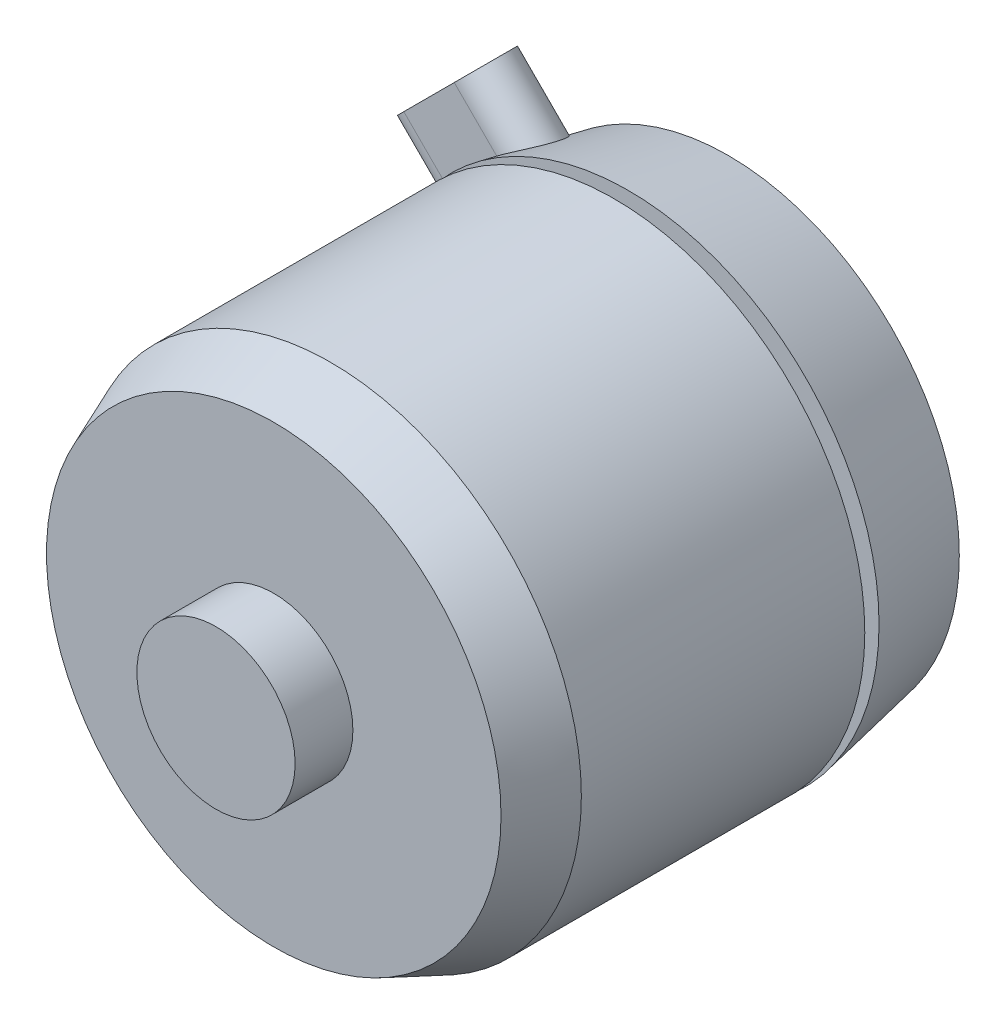
ISO-10303-21;
HEADER;
FILE_DESCRIPTION(('STEP AP214'),'2;1');
FILE_NAME('part.step','',(''),(''),'','','');
FILE_SCHEMA(('AUTOMOTIVE_DESIGN { 1 0 10303 214 1 1 1 1 }'));
ENDSEC;
DATA;
#1=APPLICATION_CONTEXT('core data for automotive mechanical design processes');
#2=APPLICATION_PROTOCOL_DEFINITION('international standard','automotive_design',2000,#1);
#3=PRODUCT_CONTEXT('',#1,'mechanical');
#4=PRODUCT('Part','Part','',(#3));
#5=PRODUCT_RELATED_PRODUCT_CATEGORY('part','',(#4));
#6=PRODUCT_DEFINITION_FORMATION('','',#4);
#7=PRODUCT_DEFINITION_CONTEXT('part definition',#1,'design');
#8=PRODUCT_DEFINITION('design','',#6,#7);
#9=PRODUCT_DEFINITION_SHAPE('','',#8);
#10=(LENGTH_UNIT() NAMED_UNIT(*) SI_UNIT(.MILLI.,.METRE.));
#11=(NAMED_UNIT(*) PLANE_ANGLE_UNIT() SI_UNIT($,.RADIAN.));
#12=(NAMED_UNIT(*) SI_UNIT($,.STERADIAN.) SOLID_ANGLE_UNIT());
#13=UNCERTAINTY_MEASURE_WITH_UNIT(LENGTH_MEASURE(1.E-05),#10,'distance_accuracy_value','');
#14=(GEOMETRIC_REPRESENTATION_CONTEXT(3) GLOBAL_UNCERTAINTY_ASSIGNED_CONTEXT((#13)) GLOBAL_UNIT_ASSIGNED_CONTEXT((#10,
#11,#12)) REPRESENTATION_CONTEXT('',''));
#15=CARTESIAN_POINT('',(0.,0.,0.));
#16=DIRECTION('',(0.,0.,1.));
#17=DIRECTION('',(1.,0.,0.));
#18=AXIS2_PLACEMENT_3D('',#15,#16,#17);
#19=CARTESIAN_POINT('',(0.,0.,-35.9313000000001));
#20=DIRECTION('',(0.,0.,1.));
#21=DIRECTION('',(1.,0.,0.));
#22=AXIS2_PLACEMENT_3D('',#19,#20,#21);
#23=CONICAL_SURFACE('',#22,16.205000102,0.193271290948665);
#24=CARTESIAN_POINT('',(0.,0.,-35.9313000000001));
#25=DIRECTION('',(0.,0.,1.));
#26=DIRECTION('',(1.,0.,0.));
#27=AXIS2_PLACEMENT_3D('',#24,#25,#26);
#28=CIRCLE('',#27,16.205000102);
#29=CARTESIAN_POINT('',(16.205000102,0.,-35.9313000000001));
#30=VERTEX_POINT('',#29);
#31=EDGE_CURVE('E139',#30,#30,#28,.T.);
#32=ORIENTED_EDGE('',*,*,#31,.T.);
#33=EDGE_LOOP('',(#32));
#34=FACE_BOUND('',#33,.T.);
#35=CARTESIAN_POINT('',(0.,0.,-28.9313));
#36=DIRECTION('',(0.,0.,1.));
#37=DIRECTION('',(1.,0.,0.));
#38=AXIS2_PLACEMENT_3D('',#35,#36,#37);
#39=CIRCLE('',#38,17.575);
#40=CARTESIAN_POINT('',(17.575,0.,-28.9313));
#41=VERTEX_POINT('',#40);
#42=EDGE_CURVE('E142',#41,#41,#39,.T.);
#43=ORIENTED_EDGE('',*,*,#42,.F.);
#44=EDGE_LOOP('',(#43));
#45=FACE_BOUND('',#44,.T.);
#46=CARTESIAN_POINT('',(-14.6016099773207,8.38845156644895,-32.6886659903384));
#47=CARTESIAN_POINT('',(-14.634842600694,8.37199908024057,-32.5833121695496));
#48=CARTESIAN_POINT('',(-14.6638184328655,8.36387313299757,-32.4752219123758));
#49=CARTESIAN_POINT('',(-14.7126765892852,8.36439813635956,-32.2569589711486));
#50=CARTESIAN_POINT('',(-14.7325460256369,8.37307277400593,-32.1467835641319));
#51=CARTESIAN_POINT('',(-14.762801713273,8.40652937535166,-31.9278842343341));
#52=CARTESIAN_POINT('',(-14.7732113242243,8.43127140221818,-31.8191573930095));
#53=CARTESIAN_POINT('',(-14.7844906574289,8.49562620709599,-31.6057348715184));
#54=CARTESIAN_POINT('',(-14.7853615427116,8.53523717157123,-31.501038701455));
#55=CARTESIAN_POINT('',(-14.7773995719537,8.62958273782176,-31.2941870603564));
#56=CARTESIAN_POINT('',(-14.7681908399917,8.68484211043588,-31.192285668546));
#57=CARTESIAN_POINT('',(-14.7395385904898,8.80779927783415,-30.9978441012523));
#58=CARTESIAN_POINT('',(-14.7200919256182,8.87550089342789,-30.9053068149051));
#59=CARTESIAN_POINT('',(-14.6699394625699,9.02473326377082,-30.7276084636474));
#60=CARTESIAN_POINT('',(-14.6387408389036,9.10676963676632,-30.6430098137074));
#61=CARTESIAN_POINT('',(-14.5655754995301,9.27964747576915,-30.4887508653947));
#62=CARTESIAN_POINT('',(-14.5236074831435,9.37049000451983,-30.4190923732951));
#63=CARTESIAN_POINT('',(-14.4292313453783,9.55865730113803,-30.2965945836402));
#64=CARTESIAN_POINT('',(-14.3767758660356,9.65601008945664,-30.2438345131284));
#65=CARTESIAN_POINT('',(-14.2624991443972,9.85373387655455,-30.1576086280663));
#66=CARTESIAN_POINT('',(-14.2006805564987,9.95410401348637,-30.1241373581128));
#67=CARTESIAN_POINT('',(-14.0721239400299,10.1500221925748,-30.079163173143));
#68=CARTESIAN_POINT('',(-14.0057300739443,10.2455849376161,-30.0667437997778));
#69=CARTESIAN_POINT('',(-13.8676284272442,10.433313199939,-30.0619294811444));
#70=CARTESIAN_POINT('',(-13.7959227520706,10.5254800417924,-30.0695266427642));
#71=CARTESIAN_POINT('',(-13.6537521286008,10.6982963832264,-30.1038811028768));
#72=CARTESIAN_POINT('',(-13.583449644454,10.7793029523092,-30.1295209729508));
#73=CARTESIAN_POINT('',(-13.4425199034771,10.9332734305128,-30.1981536639687));
#74=CARTESIAN_POINT('',(-13.3718927042695,11.0062387132638,-30.2411435152831));
#75=CARTESIAN_POINT('',(-13.2345515561642,11.1404020792173,-30.3418712087139));
#76=CARTESIAN_POINT('',(-13.1677835472345,11.2018589202329,-30.39919197949));
#77=CARTESIAN_POINT('',(-13.0383696318835,11.313974669607,-30.5274211989776));
#78=CARTESIAN_POINT('',(-12.975723906153,11.3646331048596,-30.5983302427676));
#79=CARTESIAN_POINT('',(-12.8557175693917,11.4548389962295,-30.7527475928506));
#80=CARTESIAN_POINT('',(-12.7984398724843,11.4942269571268,-30.8364132924377));
#81=CARTESIAN_POINT('',(-12.6919049156864,11.5604134930848,-31.0132814498277));
#82=CARTESIAN_POINT('',(-12.642648891854,11.5872101291477,-31.1064853737774));
#83=CARTESIAN_POINT('',(-12.5521552167927,11.6286319811491,-31.3031220484384));
#84=CARTESIAN_POINT('',(-12.5112324274909,11.6428305479755,-31.4067896168813));
#85=CARTESIAN_POINT('',(-12.4407198514969,11.6575335740332,-31.618842406424));
#86=CARTESIAN_POINT('',(-12.4111317076246,11.6580360489213,-31.727228308856));
#87=CARTESIAN_POINT('',(-12.3634857100122,11.6453835851231,-31.9488522085792));
#88=CARTESIAN_POINT('',(-12.3457661731189,11.6318538757433,-32.0621417671214));
#89=CARTESIAN_POINT('',(-12.3236473352216,11.5909953160337,-32.2875276015672));
#90=CARTESIAN_POINT('',(-12.3192489227691,11.5636655453482,-32.3996237973736));
#91=CARTESIAN_POINT('',(-12.3237960737819,11.4954630817882,-32.6207593487628));
#92=CARTESIAN_POINT('',(-12.3328959266631,11.4544380176279,-32.7297486203045));
#93=CARTESIAN_POINT('',(-12.3642235118109,11.3598429942025,-32.9401327952284));
#94=CARTESIAN_POINT('',(-12.3864513172332,11.3062729650315,-33.0415276562871));
#95=CARTESIAN_POINT('',(-12.4430541055863,11.1877628007381,-33.2337344235115));
#96=CARTESIAN_POINT('',(-12.477429241509,11.122822522416,-33.3245461963672));
#97=CARTESIAN_POINT('',(-12.5569176519012,10.9830316697916,-33.4928694671897));
#98=CARTESIAN_POINT('',(-12.6020307652775,10.9081812441709,-33.570381164657));
#99=CARTESIAN_POINT('',(-12.7010672465329,10.7505996153694,-33.7095211473427));
#100=CARTESIAN_POINT('',(-12.754958886876,10.6678972240885,-33.7712046446477));
#101=CARTESIAN_POINT('',(-12.8697003994902,10.4964008219273,-33.8771860414134));
#102=CARTESIAN_POINT('',(-12.9305502200186,10.4076068563475,-33.9214840701459));
#103=CARTESIAN_POINT('',(-13.0568813454985,10.2265509092819,-33.9912062641523));
#104=CARTESIAN_POINT('',(-13.1223439722259,10.1343035510881,-34.0167022375275));
#105=CARTESIAN_POINT('',(-13.2560368052312,9.94849501858593,-34.0482873318148));
#106=CARTESIAN_POINT('',(-13.3242669950693,9.85493385208403,-34.0543765679897));
#107=CARTESIAN_POINT('',(-13.4611081561398,9.66968362442083,-34.0468931458941));
#108=CARTESIAN_POINT('',(-13.5297148857395,9.5779870355632,-34.0334298814884));
#109=CARTESIAN_POINT('',(-13.6658308796846,9.39869824717512,-33.9872935024604));
#110=CARTESIAN_POINT('',(-13.7333402240454,9.3111057475126,-33.9546217949265));
#111=CARTESIAN_POINT('',(-13.8647352089587,9.14390840243715,-33.8713815242015));
#112=CARTESIAN_POINT('',(-13.9286552517826,9.06421842934111,-33.82103845669));
#113=CARTESIAN_POINT('',(-14.0522556510699,8.91434509136749,-33.7036797826081));
#114=CARTESIAN_POINT('',(-14.1119355870875,8.84416266862749,-33.6366625255958));
#115=CARTESIAN_POINT('',(-14.224399604507,8.71735155344005,-33.4895106128487));
#116=CARTESIAN_POINT('',(-14.2773067976372,8.66045794093949,-33.4096980612615));
#117=CARTESIAN_POINT('',(-14.376528730516,8.56047481783559,-33.238326257285));
#118=CARTESIAN_POINT('',(-14.4228525797337,8.51736612744463,-33.146783576494));
#119=CARTESIAN_POINT('',(-14.4909174564844,8.46069809631754,-32.9932331906523));
#120=CARTESIAN_POINT('',(-14.5150823082757,8.44221541325259,-32.9340495247598));
#121=CARTESIAN_POINT('',(-14.560537484111,8.41098899754414,-32.8131223888407));
#122=CARTESIAN_POINT('',(-14.581827896855,8.39824508778431,-32.7513789978796));
#123=CARTESIAN_POINT('',(-14.6016099773207,8.38845156644895,-32.6886659903384));
#124=B_SPLINE_CURVE_WITH_KNOTS('',3,(#46,#47,#48,#49,#50,#51,#52,#53,#54,#55,#56,#57,#58,#59,
#60,#61,#62,#63,#64,#65,#66,#67,#68,#69,#70,#71,#72,#73,#74,#75,#76,#77,#78,#79,#80,#81,#82,#83,
#84,#85,#86,#87,#88,#89,#90,#91,#92,#93,#94,#95,#96,#97,#98,#99,#100,#101,#102,#103,#104,#105,
#106,#107,#108,#109,#110,#111,#112,#113,#114,#115,#116,#117,#118,#119,#120,#121,#122,#123),
.UNSPECIFIED.,.T.,.F.,(4,2,2,2,2,2,2,2,2,2,2,2,2,2,2,2,2,2,2,2,2,2,2,2,2,2,2,2,2,2,2,2,2,2,2,2,
2,2,4),(0.,0.334812945777553,0.670098285923879,1.004553419853,1.3389677741727,1.68629099905919,
2.03372105999401,2.39772396462672,2.76177085262863,3.12750037826985,3.49312641471029,
3.84238292376329,4.19150173125405,4.52071000297399,4.84986195115981,5.17036758531357,
5.49088725875425,5.81574074098605,6.14064423256194,6.47617184195042,6.81174806362943,
7.15652349559078,7.50132192440513,7.85009199768231,8.19886401450316,8.54764042415769,
8.89641160172601,9.24394912657252,9.59148406721027,9.93768474244683,10.2838833614838,
10.6281524875466,10.9723963977843,11.3123983500539,11.6524339697405,11.9849658480546,
12.31703302114,12.5163402198451,12.7156412668903),.UNSPECIFIED.);
#125=CARTESIAN_POINT('',(-13.3535901370009,9.81536922529965,-34.0517000000001));
#126=VERTEX_POINT('',#125);
#127=CARTESIAN_POINT('',(-13.911571035946,10.3733501242448,-30.0639000000001));
#128=VERTEX_POINT('',#127);
#129=EDGE_CURVE('E11',#126,#128,#124,.T.);
#130=ORIENTED_EDGE('',*,*,#129,.F.);
#131=CARTESIAN_POINT('',(0.,0.,-34.0517000000001));
#132=DIRECTION('',(0.,0.,1.));
#133=DIRECTION('',(1.,0.,0.));
#134=AXIS2_PLACEMENT_3D('',#131,#132,#133);
#135=CIRCLE('',#134,16.5728646460401);
#136=CARTESIAN_POINT('',(-9.81536922529961,13.3535901370009,-34.0517000000001));
#137=VERTEX_POINT('',#136);
#138=EDGE_CURVE('E166',#137,#126,#135,.T.);
#139=ORIENTED_EDGE('',*,*,#138,.F.);
#140=CARTESIAN_POINT('',(-11.4835724268982,12.3278639655742,-32.6468751026648));
#141=CARTESIAN_POINT('',(-11.5233089908037,12.3199793146857,-32.5379697359097));
#142=CARTESIAN_POINT('',(-11.5565395383845,12.3188048312591,-32.4261240476924));
#143=CARTESIAN_POINT('',(-11.6091749425025,12.3301214688838,-32.1998071651669));
#144=CARTESIAN_POINT('',(-11.6285643677337,12.3426278033189,-32.0853331868544));
#145=CARTESIAN_POINT('',(-11.6529352105447,12.3810318009195,-31.8571103634868));
#146=CARTESIAN_POINT('',(-11.6579195853778,12.4069267142189,-31.7433613743816));
#147=CARTESIAN_POINT('',(-11.6531596397004,12.4713379756775,-31.5198326026762));
#148=CARTESIAN_POINT('',(-11.6434185545412,12.5098515499172,-31.4100519536123));
#149=CARTESIAN_POINT('',(-11.6092333757088,12.5980007272363,-31.1982763113292));
#150=CARTESIAN_POINT('',(-11.5848814812739,12.6475653719606,-31.0962369785495));
#151=CARTESIAN_POINT('',(-11.5217453616937,12.7563172755009,-30.9022330445163));
#152=CARTESIAN_POINT('',(-11.4829624816104,12.8155036372207,-30.8102675053533));
#153=CARTESIAN_POINT('',(-11.3926645641297,12.9398972471939,-30.6413982526509));
#154=CARTESIAN_POINT('',(-11.3414847598062,13.0049214474833,-30.5641807153038));
#155=CARTESIAN_POINT('',(-11.2269307847083,13.1399105184135,-30.4245262682105));
#156=CARTESIAN_POINT('',(-11.1635596404794,13.2098741600964,-30.3620856985891));
#157=CARTESIAN_POINT('',(-11.0284777295514,13.3498168844718,-30.2558298293898));
#158=CARTESIAN_POINT('',(-10.9571233874396,13.4197147074057,-30.2114538836039));
#159=CARTESIAN_POINT('',(-10.8062949188492,13.5594387595405,-30.1396495765171));
#160=CARTESIAN_POINT('',(-10.7268219999915,13.6292649978332,-30.1122186989387));
#161=CARTESIAN_POINT('',(-10.5634687028822,13.7653619420765,-30.0752700695659));
#162=CARTESIAN_POINT('',(-10.4796929360796,13.8316739559068,-30.0654398692298));
#163=CARTESIAN_POINT('',(-10.3087903195187,13.960181370171,-30.062694864946));
#164=CARTESIAN_POINT('',(-10.2216632445862,14.0223764932245,-30.0697811995801));
#165=CARTESIAN_POINT('',(-10.0447340152395,14.142277614552,-30.1005858361569));
#166=CARTESIAN_POINT('',(-9.95491285499129,14.1998721571256,-30.1246264007287));
#167=CARTESIAN_POINT('',(-9.77670512578685,14.3079872209419,-30.1886204399834));
#168=CARTESIAN_POINT('',(-9.68831889281578,14.3585061059664,-30.2285775871289));
#169=CARTESIAN_POINT('',(-9.51077969369386,14.4540466555817,-30.3255111469786));
#170=CARTESIAN_POINT('',(-9.42182343391715,14.4986489546665,-30.383260808253));
#171=CARTESIAN_POINT('',(-9.25043990031008,14.578498776865,-30.5131337212742));
#172=CARTESIAN_POINT('',(-9.16801457457114,14.6137435160569,-30.585261239358));
#173=CARTESIAN_POINT('',(-9.00785214506958,14.6761007043782,-30.7461451253345));
#174=CARTESIAN_POINT('',(-8.9305861650628,14.702691010565,-30.835574214776));
#175=CARTESIAN_POINT('',(-8.78822690706749,14.7448555406336,-31.025998275119));
#176=CARTESIAN_POINT('',(-8.72313568008767,14.7604279096161,-31.1269951901713));
#177=CARTESIAN_POINT('',(-8.60661912890206,14.7805625003129,-31.3395148084796));
#178=CARTESIAN_POINT('',(-8.55540000787534,14.784965959718,-31.4511661298507));
#179=CARTESIAN_POINT('',(-8.47007019730404,14.7822613653193,-31.680709722113));
#180=CARTESIAN_POINT('',(-8.43595576280198,14.7751558327753,-31.7986006206357));
#181=CARTESIAN_POINT('',(-8.38753482317188,14.750025424528,-32.0326468807332));
#182=CARTESIAN_POINT('',(-8.37253825387613,14.7324168584916,-32.1487034917288));
#183=CARTESIAN_POINT('',(-8.36106477480697,14.6869293131229,-32.3797139068226));
#184=CARTESIAN_POINT('',(-8.36458066870465,14.6590543285624,-32.4946681220471));
#185=CARTESIAN_POINT('',(-8.38956661158817,14.5954315864024,-32.7132975722218));
#186=CARTESIAN_POINT('',(-8.41001915437308,14.5602127479335,-32.8172438421486));
#187=CARTESIAN_POINT('',(-8.46692062183518,14.4818217264066,-33.0174706981619));
#188=CARTESIAN_POINT('',(-8.50336661675714,14.4386510008525,-33.113752684413));
#189=CARTESIAN_POINT('',(-8.58956589667766,14.3466716190708,-33.2929322658334));
#190=CARTESIAN_POINT('',(-8.63888914726134,14.2980699003034,-33.3761437621145));
#191=CARTESIAN_POINT('',(-8.74950948858695,14.1952386310754,-33.5302036890061));
#192=CARTESIAN_POINT('',(-8.81080677973955,14.1410089864268,-33.6010519126538));
#193=CARTESIAN_POINT('',(-8.9437312071901,14.0276355259366,-33.7289759754204));
#194=CARTESIAN_POINT('',(-9.01543054631068,13.9684586996792,-33.78594740413));
#195=CARTESIAN_POINT('',(-9.16646134090263,13.8468005821789,-33.8840322396819));
#196=CARTESIAN_POINT('',(-9.2457936718022,13.7843189122743,-33.9251438248428));
#197=CARTESIAN_POINT('',(-9.41168179171987,13.6558733442747,-33.9913598309038));
#198=CARTESIAN_POINT('',(-9.4983668996515,13.5898616408295,-34.0160475965884));
#199=CARTESIAN_POINT('',(-9.67464055958464,13.4574224134404,-34.0472452333214));
#200=CARTESIAN_POINT('',(-9.76422942337782,13.3909948454649,-34.0537531457176));
#201=CARTESIAN_POINT('',(-9.94571842605602,13.2580701236492,-34.0484650951935));
#202=CARTESIAN_POINT('',(-10.0376276935836,13.1916006141093,-34.0362831734193));
#203=CARTESIAN_POINT('',(-10.2194018719038,13.0619655329632,-33.9933238749222));
#204=CARTESIAN_POINT('',(-10.3092667339095,12.9988000401563,-33.9625460549145));
#205=CARTESIAN_POINT('',(-10.4856318577479,12.8770785127868,-33.8828818666713));
#206=CARTESIAN_POINT('',(-10.572083906125,12.8185811948719,-33.8337989554474));
#207=CARTESIAN_POINT('',(-10.7384312220881,12.7089778970478,-33.7190195101585));
#208=CARTESIAN_POINT('',(-10.8183248732457,12.6578737369561,-33.6533188965656));
#209=CARTESIAN_POINT('',(-10.9700783542475,12.5646689687126,-33.5068444745027));
#210=CARTESIAN_POINT('',(-11.0418896708477,12.5226214748372,-33.425986683745));
#211=CARTESIAN_POINT('',(-11.1752607847351,12.4495700229516,-33.2518967749589));
#212=CARTESIAN_POINT('',(-11.2368311997859,12.4185545884259,-33.1586776557213));
#213=CARTESIAN_POINT('',(-11.3297683651557,12.3771041695937,-32.9954042454555));
#214=CARTESIAN_POINT('',(-11.3643574058647,12.3632552392139,-32.928001967464));
#215=CARTESIAN_POINT('',(-11.4281056602938,12.3412451468041,-32.7897877534795));
#216=CARTESIAN_POINT('',(-11.4572648667908,12.3330839923401,-32.718975812951));
#217=CARTESIAN_POINT('',(-11.4835724268982,12.3278639655742,-32.6468751026648));
#218=B_SPLINE_CURVE_WITH_KNOTS('',3,(#140,#141,#142,#143,#144,#145,#146,#147,#148,#149,#150,
#151,#152,#153,#154,#155,#156,#157,#158,#159,#160,#161,#162,#163,#164,#165,#166,#167,#168,#169,
#170,#171,#172,#173,#174,#175,#176,#177,#178,#179,#180,#181,#182,#183,#184,#185,#186,#187,#188,
#189,#190,#191,#192,#193,#194,#195,#196,#197,#198,#199,#200,#201,#202,#203,#204,#205,#206,#207,
#208,#209,#210,#211,#212,#213,#214,#215,#216,#217),.UNSPECIFIED.,.T.,.F.,(4,2,2,2,2,2,2,2,2,2,2,
2,2,2,2,2,2,2,2,2,2,2,2,2,2,2,2,2,2,2,2,2,2,2,2,2,2,2,4),(0.,0.348309737496004,
0.697007197530077,1.04563306739714,1.394182351324,1.74055496736378,2.08689530730048,
2.42474993503191,2.76252079707625,3.08881758856235,3.41506591457316,3.73546297371804,
4.05588159806702,4.38256080331072,4.70931542755365,5.05296716038268,5.39672101708162,
5.75846540301257,6.12027067510275,6.48719077711137,6.85403050928316,7.20721492155243,
7.56026205098267,7.8935183822862,8.22671369160619,8.54995585609464,8.87320343118186,
9.19881282020684,9.52445959800377,9.85808115230418,10.1917386487756,10.5323797377411,
10.8730289471528,11.2174462704158,11.5619482278888,11.9084186494313,12.2545275806081,
12.4851254548442,12.7157236358277),.UNSPECIFIED.);
#219=CARTESIAN_POINT('',(-10.3733501242447,13.911571035946,-30.0639000000001));
#220=VERTEX_POINT('',#219);
#221=EDGE_CURVE('E58',#220,#137,#218,.T.);
#222=ORIENTED_EDGE('',*,*,#221,.F.);
#223=CARTESIAN_POINT('',(0.,0.,-30.0639000000001));
#224=DIRECTION('',(0.,0.,-1.));
#225=DIRECTION('',(-1.,0.,0.));
#226=AXIS2_PLACEMENT_3D('',#223,#224,#225);
#227=CIRCLE('',#226,17.3533340165036);
#228=EDGE_CURVE('E48',#128,#220,#227,.T.);
#229=ORIENTED_EDGE('',*,*,#228,.F.);
#230=EDGE_LOOP('',(#130,#139,#222,#229));
#231=FACE_BOUND('',#230,.T.);
#232=ADVANCED_FACE('F36',(#34,#45,#231),#23,.T.);
#233=CARTESIAN_POINT('',(0.,0.,0.));
#234=DIRECTION('',(0.,0.,-1.));
#235=DIRECTION('',(-1.,0.,0.));
#236=AXIS2_PLACEMENT_3D('',#233,#234,#235);
#237=PLANE('',#236);
#238=CARTESIAN_POINT('',(0.,0.,0.));
#239=DIRECTION('',(0.,0.,1.));
#240=DIRECTION('',(1.,0.,0.));
#241=AXIS2_PLACEMENT_3D('',#238,#239,#240);
#242=CIRCLE('',#241,5.5499);
#243=CARTESIAN_POINT('',(5.5499,0.,0.));
#244=VERTEX_POINT('',#243);
#245=EDGE_CURVE('E163',#244,#244,#242,.T.);
#246=ORIENTED_EDGE('',*,*,#245,.T.);
#247=EDGE_LOOP('',(#246));
#248=FACE_BOUND('',#247,.T.);
#249=ADVANCED_FACE('F38',(#248),#237,.F.);
#250=CARTESIAN_POINT('',(0.,0.,1000.));
#251=DIRECTION('',(0.,0.,1.));
#252=DIRECTION('',(1.,0.,0.));
#253=AXIS2_PLACEMENT_3D('',#250,#251,#252);
#254=CYLINDRICAL_SURFACE('',#253,5.5499);
#255=ORIENTED_EDGE('',*,*,#245,.F.);
#256=EDGE_LOOP('',(#255));
#257=FACE_BOUND('',#256,.T.);
#258=CARTESIAN_POINT('',(0.,0.,-4.05129999999998));
#259=DIRECTION('',(0.,0.,1.));
#260=DIRECTION('',(1.,0.,0.));
#261=AXIS2_PLACEMENT_3D('',#258,#259,#260);
#262=CIRCLE('',#261,5.5499);
#263=CARTESIAN_POINT('',(5.5499,0.,-4.05129999999998));
#264=VERTEX_POINT('',#263);
#265=EDGE_CURVE('E160',#264,#264,#262,.T.);
#266=ORIENTED_EDGE('',*,*,#265,.T.);
#267=EDGE_LOOP('',(#266));
#268=FACE_BOUND('',#267,.T.);
#269=ADVANCED_FACE('F234',(#257,#268),#254,.T.);
#270=CARTESIAN_POINT('',(0.,5.5499,-4.0513));
#271=DIRECTION('',(0.,0.,-1.));
#272=DIRECTION('',(-1.,0.,0.));
#273=AXIS2_PLACEMENT_3D('',#270,#271,#272);
#274=PLANE('',#273);
#275=ORIENTED_EDGE('',*,*,#265,.F.);
#276=EDGE_LOOP('',(#275));
#277=FACE_BOUND('',#276,.T.);
#278=CARTESIAN_POINT('',(0.,0.,-4.05129999999998));
#279=DIRECTION('',(0.,0.,1.));
#280=DIRECTION('',(1.,0.,0.));
#281=AXIS2_PLACEMENT_3D('',#278,#279,#280);
#282=CIRCLE('',#281,15.94);
#283=CARTESIAN_POINT('',(15.94,0.,-4.05129999999998));
#284=VERTEX_POINT('',#283);
#285=EDGE_CURVE('E157',#284,#284,#282,.T.);
#286=ORIENTED_EDGE('',*,*,#285,.T.);
#287=EDGE_LOOP('',(#286));
#288=FACE_BOUND('',#287,.T.);
#289=ADVANCED_FACE('F387',(#277,#288),#274,.F.);
#290=CARTESIAN_POINT('',(0.,0.,-8.05129999999998));
#291=DIRECTION('',(0.,0.,-1.));
#292=DIRECTION('',(-1.,0.,0.));
#293=AXIS2_PLACEMENT_3D('',#290,#291,#292);
#294=CONICAL_SURFACE('',#293,17.575,0.388026647889187);
#295=ORIENTED_EDGE('',*,*,#285,.F.);
#296=EDGE_LOOP('',(#295));
#297=FACE_BOUND('',#296,.T.);
#298=CARTESIAN_POINT('',(0.,0.,-8.05129999999998));
#299=DIRECTION('',(0.,0.,1.));
#300=DIRECTION('',(1.,0.,0.));
#301=AXIS2_PLACEMENT_3D('',#298,#299,#300);
#302=CIRCLE('',#301,17.575);
#303=CARTESIAN_POINT('',(17.575,0.,-8.05129999999998));
#304=VERTEX_POINT('',#303);
#305=EDGE_CURVE('E154',#304,#304,#302,.T.);
#306=ORIENTED_EDGE('',*,*,#305,.T.);
#307=EDGE_LOOP('',(#306));
#308=FACE_BOUND('',#307,.T.);
#309=ADVANCED_FACE('F377',(#297,#308),#294,.T.);
#310=CARTESIAN_POINT('',(0.,0.,1000.));
#311=DIRECTION('',(0.,0.,1.));
#312=DIRECTION('',(1.,0.,0.));
#313=AXIS2_PLACEMENT_3D('',#310,#311,#312);
#314=CYLINDRICAL_SURFACE('',#313,17.575);
#315=ORIENTED_EDGE('',*,*,#305,.F.);
#316=EDGE_LOOP('',(#315));
#317=FACE_BOUND('',#316,.T.);
#318=CARTESIAN_POINT('',(0.,0.,-27.9313000000001));
#319=DIRECTION('',(0.,0.,1.));
#320=DIRECTION('',(1.,0.,0.));
#321=AXIS2_PLACEMENT_3D('',#318,#319,#320);
#322=CIRCLE('',#321,17.575);
#323=CARTESIAN_POINT('',(17.575,0.,-27.9313000000001));
#324=VERTEX_POINT('',#323);
#325=EDGE_CURVE('E151',#324,#324,#322,.T.);
#326=ORIENTED_EDGE('',*,*,#325,.T.);
#327=EDGE_LOOP('',(#326));
#328=FACE_BOUND('',#327,.T.);
#329=ADVANCED_FACE('F367',(#317,#328),#314,.T.);
#330=CARTESIAN_POINT('',(0.,6.01983394375338,-27.9313));
#331=DIRECTION('',(0.,0.,1.));
#332=DIRECTION('',(1.,0.,0.));
#333=AXIS2_PLACEMENT_3D('',#330,#331,#332);
#334=PLANE('',#333);
#335=ORIENTED_EDGE('',*,*,#325,.F.);
#336=EDGE_LOOP('',(#335));
#337=FACE_BOUND('',#336,.T.);
#338=CARTESIAN_POINT('',(0.,0.,-27.9313000000001));
#339=DIRECTION('',(0.,0.,1.));
#340=DIRECTION('',(1.,0.,0.));
#341=AXIS2_PLACEMENT_3D('',#338,#339,#340);
#342=CIRCLE('',#341,6.01983394375338);
#343=CARTESIAN_POINT('',(6.01983394375338,0.,-27.9313000000001));
#344=VERTEX_POINT('',#343);
#345=EDGE_CURVE('E148',#344,#344,#342,.T.);
#346=ORIENTED_EDGE('',*,*,#345,.T.);
#347=EDGE_LOOP('',(#346));
#348=FACE_BOUND('',#347,.T.);
#349=ADVANCED_FACE('F357',(#337,#348),#334,.F.);
#350=CARTESIAN_POINT('',(0.,0.,1000.));
#351=DIRECTION('',(0.,0.,1.));
#352=DIRECTION('',(1.,0.,0.));
#353=AXIS2_PLACEMENT_3D('',#350,#351,#352);
#354=CYLINDRICAL_SURFACE('',#353,6.01983394375338);
#355=ORIENTED_EDGE('',*,*,#345,.F.);
#356=EDGE_LOOP('',(#355));
#357=FACE_BOUND('',#356,.T.);
#358=CARTESIAN_POINT('',(0.,0.,-28.9313));
#359=DIRECTION('',(0.,0.,1.));
#360=DIRECTION('',(1.,0.,0.));
#361=AXIS2_PLACEMENT_3D('',#358,#359,#360);
#362=CIRCLE('',#361,6.01983394375338);
#363=CARTESIAN_POINT('',(6.01983394375338,0.,-28.9313));
#364=VERTEX_POINT('',#363);
#365=EDGE_CURVE('E145',#364,#364,#362,.T.);
#366=ORIENTED_EDGE('',*,*,#365,.T.);
#367=EDGE_LOOP('',(#366));
#368=FACE_BOUND('',#367,.T.);
#369=ADVANCED_FACE('F225',(#357,#368),#354,.T.);
#370=CARTESIAN_POINT('',(0.,17.575,-28.9313));
#371=DIRECTION('',(0.,0.,-1.));
#372=DIRECTION('',(-1.,0.,0.));
#373=AXIS2_PLACEMENT_3D('',#370,#371,#372);
#374=PLANE('',#373);
#375=CARTESIAN_POINT('',(0.,-9.54499999999996,-28.9313000000001));
#376=DIRECTION('',(0.,0.,-1.));
#377=DIRECTION('',(-1.,0.,0.));
#378=AXIS2_PLACEMENT_3D('',#375,#376,#377);
#379=CIRCLE('',#378,1.29);
#380=CARTESIAN_POINT('',(-1.29000000000007,-9.54499999999996,-28.9313000000001));
#381=VERTEX_POINT('',#380);
#382=EDGE_CURVE('E101',#381,#381,#379,.T.);
#383=ORIENTED_EDGE('',*,*,#382,.T.);
#384=EDGE_LOOP('',(#383));
#385=FACE_BOUND('',#384,.T.);
#386=CARTESIAN_POINT('',(-12.57,0.,-28.9313000000001));
#387=DIRECTION('',(0.,0.,-1.));
#388=DIRECTION('',(-1.,0.,0.));
#389=AXIS2_PLACEMENT_3D('',#386,#387,#388);
#390=CIRCLE('',#389,1.29);
#391=CARTESIAN_POINT('',(-13.86,0.,-28.9313000000001));
#392=VERTEX_POINT('',#391);
#393=EDGE_CURVE('E110',#392,#392,#390,.T.);
#394=ORIENTED_EDGE('',*,*,#393,.T.);
#395=EDGE_LOOP('',(#394));
#396=FACE_BOUND('',#395,.T.);
#397=CARTESIAN_POINT('',(0.,9.54500000000004,-28.9313000000001));
#398=DIRECTION('',(0.,0.,-1.));
#399=DIRECTION('',(-1.,0.,0.));
#400=AXIS2_PLACEMENT_3D('',#397,#398,#399);
#401=CIRCLE('',#400,1.29);
#402=CARTESIAN_POINT('',(-1.29,9.54500000000004,-28.9313000000001));
#403=VERTEX_POINT('',#402);
#404=EDGE_CURVE('E116',#403,#403,#401,.T.);
#405=ORIENTED_EDGE('',*,*,#404,.T.);
#406=EDGE_LOOP('',(#405));
#407=FACE_BOUND('',#406,.T.);
#408=CARTESIAN_POINT('',(12.57,0.,-28.9313000000001));
#409=DIRECTION('',(0.,0.,-1.));
#410=DIRECTION('',(-1.,0.,0.));
#411=AXIS2_PLACEMENT_3D('',#408,#409,#410);
#412=CIRCLE('',#411,1.29);
#413=CARTESIAN_POINT('',(11.28,0.,-28.9313000000001));
#414=VERTEX_POINT('',#413);
#415=EDGE_CURVE('E122',#414,#414,#412,.T.);
#416=ORIENTED_EDGE('',*,*,#415,.T.);
#417=EDGE_LOOP('',(#416));
#418=FACE_BOUND('',#417,.T.);
#419=ORIENTED_EDGE('',*,*,#365,.F.);
#420=EDGE_LOOP('',(#419));
#421=FACE_BOUND('',#420,.T.);
#422=ORIENTED_EDGE('',*,*,#42,.T.);
#423=EDGE_LOOP('',(#422));
#424=FACE_BOUND('',#423,.T.);
#425=ADVANCED_FACE('F220',(#385,#396,#407,#418,#421,#424),#374,.F.);
#426=CARTESIAN_POINT('',(0.,16.205000102,-35.9313000000001));
#427=DIRECTION('',(0.,0.,1.));
#428=DIRECTION('',(1.,0.,0.));
#429=AXIS2_PLACEMENT_3D('',#426,#427,#428);
#430=PLANE('',#429);
#431=CARTESIAN_POINT('',(0.,-9.54499999999996,-35.9313000000001));
#432=DIRECTION('',(0.,0.,-1.));
#433=DIRECTION('',(-1.,0.,0.));
#434=AXIS2_PLACEMENT_3D('',#431,#432,#433);
#435=CIRCLE('',#434,1.29);
#436=CARTESIAN_POINT('',(-1.29000000000007,-9.54499999999996,-35.9313000000001));
#437=VERTEX_POINT('',#436);
#438=EDGE_CURVE('E98',#437,#437,#435,.T.);
#439=ORIENTED_EDGE('',*,*,#438,.F.);
#440=EDGE_LOOP('',(#439));
#441=FACE_BOUND('',#440,.T.);
#442=CARTESIAN_POINT('',(-12.57,0.,-35.9313000000001));
#443=DIRECTION('',(0.,0.,-1.));
#444=DIRECTION('',(-1.,0.,0.));
#445=AXIS2_PLACEMENT_3D('',#442,#443,#444);
#446=CIRCLE('',#445,1.29);
#447=CARTESIAN_POINT('',(-13.86,0.,-35.9313000000001));
#448=VERTEX_POINT('',#447);
#449=EDGE_CURVE('E108',#448,#448,#446,.T.);
#450=ORIENTED_EDGE('',*,*,#449,.F.);
#451=EDGE_LOOP('',(#450));
#452=FACE_BOUND('',#451,.T.);
#453=CARTESIAN_POINT('',(0.,9.54500000000004,-35.9313000000001));
#454=DIRECTION('',(0.,0.,-1.));
#455=DIRECTION('',(-1.,0.,0.));
#456=AXIS2_PLACEMENT_3D('',#453,#454,#455);
#457=CIRCLE('',#456,1.29);
#458=CARTESIAN_POINT('',(-1.29,9.54500000000004,-35.9313000000001));
#459=VERTEX_POINT('',#458);
#460=EDGE_CURVE('E113',#459,#459,#457,.T.);
#461=ORIENTED_EDGE('',*,*,#460,.F.);
#462=EDGE_LOOP('',(#461));
#463=FACE_BOUND('',#462,.T.);
#464=CARTESIAN_POINT('',(12.57,0.,-35.9313000000001));
#465=DIRECTION('',(0.,0.,-1.));
#466=DIRECTION('',(-1.,0.,0.));
#467=AXIS2_PLACEMENT_3D('',#464,#465,#466);
#468=CIRCLE('',#467,1.29);
#469=CARTESIAN_POINT('',(11.28,0.,-35.9313000000001));
#470=VERTEX_POINT('',#469);
#471=EDGE_CURVE('E119',#470,#470,#468,.T.);
#472=ORIENTED_EDGE('',*,*,#471,.F.);
#473=EDGE_LOOP('',(#472));
#474=FACE_BOUND('',#473,.T.);
#475=ORIENTED_EDGE('',*,*,#31,.F.);
#476=EDGE_LOOP('',(#475));
#477=FACE_BOUND('',#476,.T.);
#478=CARTESIAN_POINT('',(0.,0.,-35.9313000000001));
#479=DIRECTION('',(0.,0.,1.));
#480=DIRECTION('',(1.,0.,0.));
#481=AXIS2_PLACEMENT_3D('',#478,#479,#480);
#482=CIRCLE('',#481,4.73075);
#483=CARTESIAN_POINT('',(4.73075,0.,-35.9313000000001));
#484=VERTEX_POINT('',#483);
#485=EDGE_CURVE('E136',#484,#484,#482,.T.);
#486=ORIENTED_EDGE('',*,*,#485,.T.);
#487=EDGE_LOOP('',(#486));
#488=FACE_BOUND('',#487,.T.);
#489=ADVANCED_FACE('F217',(#441,#452,#463,#474,#477,#488),#430,.F.);
#490=CARTESIAN_POINT('',(0.,0.,1000.));
#491=DIRECTION('',(0.,0.,1.));
#492=DIRECTION('',(1.,0.,0.));
#493=AXIS2_PLACEMENT_3D('',#490,#491,#492);
#494=CYLINDRICAL_SURFACE('',#493,4.73075);
#495=ORIENTED_EDGE('',*,*,#485,.F.);
#496=EDGE_LOOP('',(#495));
#497=FACE_BOUND('',#496,.T.);
#498=CARTESIAN_POINT('',(0.,0.,-36.5154999999999));
#499=DIRECTION('',(0.,0.,1.));
#500=DIRECTION('',(1.,0.,0.));
#501=AXIS2_PLACEMENT_3D('',#498,#499,#500);
#502=CIRCLE('',#501,4.73075);
#503=CARTESIAN_POINT('',(4.73075,0.,-36.5154999999999));
#504=VERTEX_POINT('',#503);
#505=EDGE_CURVE('E133',#504,#504,#502,.T.);
#506=ORIENTED_EDGE('',*,*,#505,.T.);
#507=EDGE_LOOP('',(#506));
#508=FACE_BOUND('',#507,.T.);
#509=ADVANCED_FACE('F214',(#497,#508),#494,.T.);
#510=CARTESIAN_POINT('',(0.,4.73075,-36.5155));
#511=DIRECTION('',(0.,0.,1.));
#512=DIRECTION('',(1.,0.,0.));
#513=AXIS2_PLACEMENT_3D('',#510,#511,#512);
#514=PLANE('',#513);
#515=ORIENTED_EDGE('',*,*,#505,.F.);
#516=EDGE_LOOP('',(#515));
#517=FACE_BOUND('',#516,.T.);
#518=CARTESIAN_POINT('',(0.,0.,-36.5154999999999));
#519=DIRECTION('',(0.,0.,1.));
#520=DIRECTION('',(1.,0.,0.));
#521=AXIS2_PLACEMENT_3D('',#518,#519,#520);
#522=CIRCLE('',#521,2.4511);
#523=CARTESIAN_POINT('',(2.4511,0.,-36.5154999999999));
#524=VERTEX_POINT('',#523);
#525=EDGE_CURVE('E130',#524,#524,#522,.T.);
#526=ORIENTED_EDGE('',*,*,#525,.T.);
#527=EDGE_LOOP('',(#526));
#528=FACE_BOUND('',#527,.T.);
#529=ADVANCED_FACE('F210',(#517,#528),#514,.F.);
#530=CARTESIAN_POINT('',(0.,0.,1000.));
#531=DIRECTION('',(0.,0.,1.));
#532=DIRECTION('',(1.,0.,0.));
#533=AXIS2_PLACEMENT_3D('',#530,#531,#532);
#534=CYLINDRICAL_SURFACE('',#533,2.4511);
#535=ORIENTED_EDGE('',*,*,#525,.F.);
#536=EDGE_LOOP('',(#535));
#537=FACE_BOUND('',#536,.T.);
#538=CARTESIAN_POINT('',(0.,0.,-37.4806999999999));
#539=DIRECTION('',(0.,0.,1.));
#540=DIRECTION('',(1.,0.,0.));
#541=AXIS2_PLACEMENT_3D('',#538,#539,#540);
#542=CIRCLE('',#541,2.4511);
#543=CARTESIAN_POINT('',(2.4511,0.,-37.4806999999999));
#544=VERTEX_POINT('',#543);
#545=EDGE_CURVE('E125',#544,#544,#542,.T.);
#546=ORIENTED_EDGE('',*,*,#545,.T.);
#547=EDGE_LOOP('',(#546));
#548=FACE_BOUND('',#547,.T.);
#549=ADVANCED_FACE('F206',(#537,#548),#534,.T.);
#550=CARTESIAN_POINT('',(0.,2.4511,-37.4807));
#551=DIRECTION('',(0.,0.,1.));
#552=DIRECTION('',(1.,0.,0.));
#553=AXIS2_PLACEMENT_3D('',#550,#551,#552);
#554=PLANE('',#553);
#555=ORIENTED_EDGE('',*,*,#545,.F.);
#556=EDGE_LOOP('',(#555));
#557=FACE_BOUND('',#556,.T.);
#558=ADVANCED_FACE('F202',(#557),#554,.F.);
#559=CARTESIAN_POINT('',(12.57,0.,-28.9313000000001));
#560=DIRECTION('',(0.,0.,-1.));
#561=DIRECTION('',(-1.,0.,0.));
#562=AXIS2_PLACEMENT_3D('',#559,#560,#561);
#563=CYLINDRICAL_SURFACE('',#562,1.29);
#564=ORIENTED_EDGE('',*,*,#415,.F.);
#565=EDGE_LOOP('',(#564));
#566=FACE_BOUND('',#565,.T.);
#567=ORIENTED_EDGE('',*,*,#471,.T.);
#568=EDGE_LOOP('',(#567));
#569=FACE_BOUND('',#568,.T.);
#570=ADVANCED_FACE('F198',(#566,#569),#563,.F.);
#571=CARTESIAN_POINT('',(0.,9.54500000000004,-28.9313000000001));
#572=DIRECTION('',(0.,0.,-1.));
#573=DIRECTION('',(-1.,0.,0.));
#574=AXIS2_PLACEMENT_3D('',#571,#572,#573);
#575=CYLINDRICAL_SURFACE('',#574,1.29);
#576=ORIENTED_EDGE('',*,*,#404,.F.);
#577=EDGE_LOOP('',(#576));
#578=FACE_BOUND('',#577,.T.);
#579=ORIENTED_EDGE('',*,*,#460,.T.);
#580=EDGE_LOOP('',(#579));
#581=FACE_BOUND('',#580,.T.);
#582=ADVANCED_FACE('F194',(#578,#581),#575,.F.);
#583=CARTESIAN_POINT('',(-12.57,0.,-28.9313000000001));
#584=DIRECTION('',(0.,0.,-1.));
#585=DIRECTION('',(-1.,0.,0.));
#586=AXIS2_PLACEMENT_3D('',#583,#584,#585);
#587=CYLINDRICAL_SURFACE('',#586,1.29);
#588=ORIENTED_EDGE('',*,*,#393,.F.);
#589=EDGE_LOOP('',(#588));
#590=FACE_BOUND('',#589,.T.);
#591=ORIENTED_EDGE('',*,*,#449,.T.);
#592=EDGE_LOOP('',(#591));
#593=FACE_BOUND('',#592,.T.);
#594=ADVANCED_FACE('F190',(#590,#593),#587,.F.);
#595=CARTESIAN_POINT('',(0.,-9.54499999999996,-28.9313000000001));
#596=DIRECTION('',(0.,0.,-1.));
#597=DIRECTION('',(-1.,0.,0.));
#598=AXIS2_PLACEMENT_3D('',#595,#596,#597);
#599=CYLINDRICAL_SURFACE('',#598,1.29);
#600=ORIENTED_EDGE('',*,*,#382,.F.);
#601=EDGE_LOOP('',(#600));
#602=FACE_BOUND('',#601,.T.);
#603=ORIENTED_EDGE('',*,*,#438,.T.);
#604=EDGE_LOOP('',(#603));
#605=FACE_BOUND('',#604,.T.);
#606=ADVANCED_FACE('F187',(#602,#605),#599,.F.);
#607=CARTESIAN_POINT('',(-16.8905889715249,13.3523680598237,-32.0578000000001));
#608=DIRECTION('',(0.707106781186546,-0.707106781186549,0.));
#609=DIRECTION('',(0.707106781186549,0.707106781186546,0.));
#610=AXIS2_PLACEMENT_3D('',#607,#608,#609);
#611=CYLINDRICAL_SURFACE('',#610,1.9939);
#612=DIRECTION('',(0.707106781186546,-0.707106781186549,0.));
#613=VECTOR('',#612,1.);
#614=CARTESIAN_POINT('',(-16.8905889715249,13.3523680598237,-34.0517000000001));
#615=LINE('',#614,#613);
#616=CARTESIAN_POINT('',(-16.8905889715249,13.3523680598237,-34.0517000000001));
#617=VERTEX_POINT('',#616);
#618=EDGE_CURVE('E241',#617,#126,#615,.T.);
#619=ORIENTED_EDGE('',*,*,#618,.T.);
#620=ORIENTED_EDGE('',*,*,#129,.T.);
#621=DIRECTION('',(0.707106781186546,-0.707106781186549,0.));
#622=VECTOR('',#621,1.);
#623=CARTESIAN_POINT('',(-16.8905889715249,13.3523680598237,-30.0639000000001));
#624=LINE('',#623,#622);
#625=CARTESIAN_POINT('',(-16.8905889715249,13.3523680598237,-30.0639000000001));
#626=VERTEX_POINT('',#625);
#627=EDGE_CURVE('E81',#626,#128,#624,.T.);
#628=ORIENTED_EDGE('',*,*,#627,.F.);
#629=CARTESIAN_POINT('',(-16.8905889715249,13.3523680598237,-32.0578000000001));
#630=DIRECTION('',(-0.707106781186546,0.707106781186549,0.));
#631=DIRECTION('',(-0.707106781186549,-0.707106781186546,0.));
#632=AXIS2_PLACEMENT_3D('',#629,#630,#631);
#633=CIRCLE('',#632,1.9939);
#634=EDGE_CURVE('E87',#617,#626,#633,.T.);
#635=ORIENTED_EDGE('',*,*,#634,.F.);
#636=EDGE_LOOP('',(#619,#620,#628,#635));
#637=FACE_BOUND('',#636,.T.);
#638=ADVANCED_FACE('F97',(#637),#611,.T.);
#639=CARTESIAN_POINT('',(-16.8905889715249,13.3523680598237,-30.0639000000001));
#640=DIRECTION('',(0.,0.,-1.));
#641=DIRECTION('',(-1.,0.,0.));
#642=AXIS2_PLACEMENT_3D('',#639,#640,#641);
#643=PLANE('',#642);
#644=ORIENTED_EDGE('',*,*,#627,.T.);
#645=ORIENTED_EDGE('',*,*,#228,.T.);
#646=DIRECTION('',(0.707106781186546,-0.707106781186549,0.));
#647=VECTOR('',#646,1.);
#648=CARTESIAN_POINT('',(-13.3523680598237,16.890588971525,-30.0639000000001));
#649=LINE('',#648,#647);
#650=CARTESIAN_POINT('',(-13.3523680598237,16.890588971525,-30.0639000000001));
#651=VERTEX_POINT('',#650);
#652=EDGE_CURVE('E83',#651,#220,#649,.T.);
#653=ORIENTED_EDGE('',*,*,#652,.F.);
#654=DIRECTION('',(0.707106781186548,0.707106781186546,0.));
#655=VECTOR('',#654,1.);
#656=CARTESIAN_POINT('',(-16.8905889715249,13.3523680598237,-30.0639000000001));
#657=LINE('',#656,#655);
#658=EDGE_CURVE('E77',#626,#651,#657,.T.);
#659=ORIENTED_EDGE('',*,*,#658,.F.);
#660=EDGE_LOOP('',(#644,#645,#653,#659));
#661=FACE_BOUND('',#660,.T.);
#662=ADVANCED_FACE('F79',(#661),#643,.F.);
#663=CARTESIAN_POINT('',(-13.3523680598237,16.890588971525,-32.0578000000001));
#664=DIRECTION('',(0.707106781186546,-0.707106781186549,0.));
#665=DIRECTION('',(0.707106781186549,0.707106781186546,0.));
#666=AXIS2_PLACEMENT_3D('',#663,#664,#665);
#667=CYLINDRICAL_SURFACE('',#666,1.9939);
#668=ORIENTED_EDGE('',*,*,#652,.T.);
#669=ORIENTED_EDGE('',*,*,#221,.T.);
#670=DIRECTION('',(0.707106781186546,-0.707106781186549,0.));
#671=VECTOR('',#670,1.);
#672=CARTESIAN_POINT('',(-13.3523680598237,16.890588971525,-34.0517000000001));
#673=LINE('',#672,#671);
#674=CARTESIAN_POINT('',(-13.3523680598237,16.890588971525,-34.0517000000001));
#675=VERTEX_POINT('',#674);
#676=EDGE_CURVE('E103',#675,#137,#673,.T.);
#677=ORIENTED_EDGE('',*,*,#676,.F.);
#678=CARTESIAN_POINT('',(-13.3523680598237,16.890588971525,-32.0578000000001));
#679=DIRECTION('',(-0.707106781186546,0.707106781186549,0.));
#680=DIRECTION('',(-0.707106781186549,-0.707106781186546,0.));
#681=AXIS2_PLACEMENT_3D('',#678,#679,#680);
#682=CIRCLE('',#681,1.9939);
#683=EDGE_CURVE('E86',#651,#675,#682,.T.);
#684=ORIENTED_EDGE('',*,*,#683,.F.);
#685=EDGE_LOOP('',(#668,#669,#677,#684));
#686=FACE_BOUND('',#685,.T.);
#687=ADVANCED_FACE('F175',(#686),#667,.T.);
#688=CARTESIAN_POINT('',(-16.8905889715249,13.3523680598237,-34.0517000000001));
#689=DIRECTION('',(0.,0.,1.));
#690=DIRECTION('',(1.,0.,0.));
#691=AXIS2_PLACEMENT_3D('',#688,#689,#690);
#692=PLANE('',#691);
#693=ORIENTED_EDGE('',*,*,#676,.T.);
#694=ORIENTED_EDGE('',*,*,#138,.T.);
#695=ORIENTED_EDGE('',*,*,#618,.F.);
#696=DIRECTION('',(-0.707106781186548,-0.707106781186546,0.));
#697=VECTOR('',#696,1.);
#698=CARTESIAN_POINT('',(-16.8905889715249,13.3523680598237,-34.0517000000001));
#699=LINE('',#698,#697);
#700=EDGE_CURVE('E92',#675,#617,#699,.T.);
#701=ORIENTED_EDGE('',*,*,#700,.F.);
#702=EDGE_LOOP('',(#693,#694,#695,#701));
#703=FACE_BOUND('',#702,.T.);
#704=ADVANCED_FACE('F180',(#703),#692,.F.);
#705=CARTESIAN_POINT('',(-16.8905889715249,13.3523680598237,-32.0578000000001));
#706=DIRECTION('',(-0.707106781186546,0.707106781186549,0.));
#707=DIRECTION('',(-0.707106781186549,-0.707106781186546,0.));
#708=AXIS2_PLACEMENT_3D('',#705,#706,#707);
#709=PLANE('',#708);
#710=ORIENTED_EDGE('',*,*,#634,.T.);
#711=ORIENTED_EDGE('',*,*,#658,.T.);
#712=ORIENTED_EDGE('',*,*,#683,.T.);
#713=ORIENTED_EDGE('',*,*,#700,.T.);
#714=EDGE_LOOP('',(#710,#711,#712,#713));
#715=FACE_BOUND('',#714,.T.);
#716=ADVANCED_FACE('F90',(#715),#709,.T.);
#717=CLOSED_SHELL('',(#232,#249,#269,#289,#309,#329,#349,#369,#425,#489,#509,#529,#549,#558,
#570,#582,#594,#606,#638,#662,#687,#704,#716));
#718=MANIFOLD_SOLID_BREP('B2',#717);
#719=ADVANCED_BREP_SHAPE_REPRESENTATION('',(#18,#718),#14);
#720=SHAPE_DEFINITION_REPRESENTATION(#9,#719);
ENDSEC;
END-ISO-10303-21;
